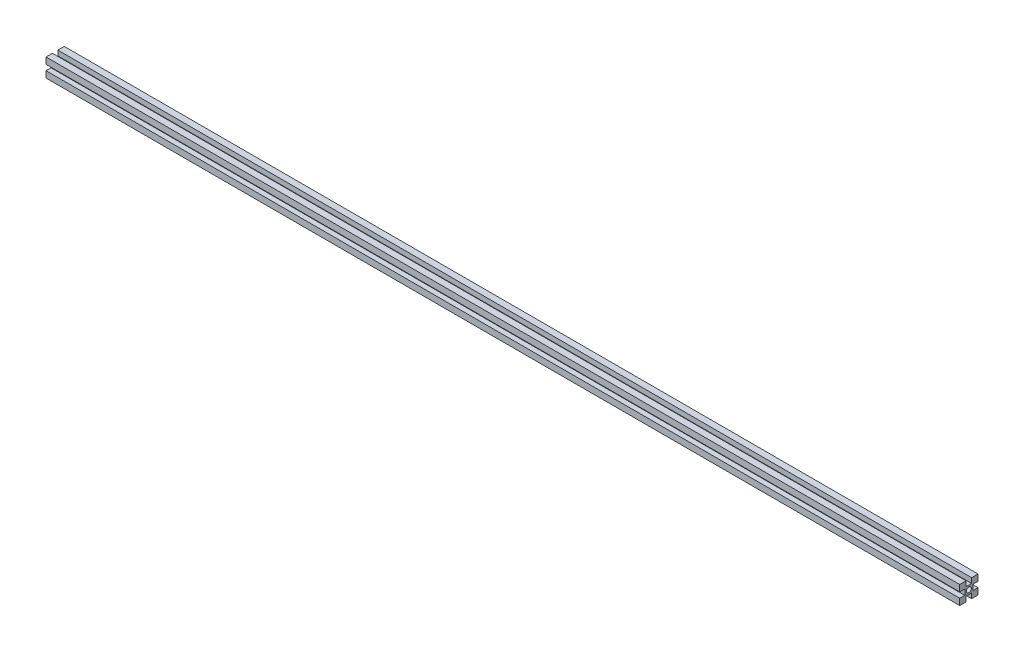
ISO-10303-21;
HEADER;
FILE_DESCRIPTION(('STEP AP214'),'2;1');
FILE_NAME('part.step','',(''),(''),'','','');
FILE_SCHEMA(('AUTOMOTIVE_DESIGN { 1 0 10303 214 1 1 1 1 }'));
ENDSEC;
DATA;
#1=APPLICATION_CONTEXT('core data for automotive mechanical design processes');
#2=APPLICATION_PROTOCOL_DEFINITION('international standard','automotive_design',2000,#1);
#3=PRODUCT_CONTEXT('',#1,'mechanical');
#4=PRODUCT('Part','Part','',(#3));
#5=PRODUCT_RELATED_PRODUCT_CATEGORY('part','',(#4));
#6=PRODUCT_DEFINITION_FORMATION('','',#4);
#7=PRODUCT_DEFINITION_CONTEXT('part definition',#1,'design');
#8=PRODUCT_DEFINITION('design','',#6,#7);
#9=PRODUCT_DEFINITION_SHAPE('','',#8);
#10=(LENGTH_UNIT() NAMED_UNIT(*) SI_UNIT(.MILLI.,.METRE.));
#11=(NAMED_UNIT(*) PLANE_ANGLE_UNIT() SI_UNIT($,.RADIAN.));
#12=(NAMED_UNIT(*) SI_UNIT($,.STERADIAN.) SOLID_ANGLE_UNIT());
#13=UNCERTAINTY_MEASURE_WITH_UNIT(LENGTH_MEASURE(1.E-05),#10,'distance_accuracy_value','');
#14=(GEOMETRIC_REPRESENTATION_CONTEXT(3) GLOBAL_UNCERTAINTY_ASSIGNED_CONTEXT((#13)) GLOBAL_UNIT_ASSIGNED_CONTEXT((#10,
#11,#12)) REPRESENTATION_CONTEXT('',''));
#15=CARTESIAN_POINT('',(0.,0.,0.));
#16=DIRECTION('',(0.,0.,1.));
#17=DIRECTION('',(1.,0.,0.));
#18=AXIS2_PLACEMENT_3D('',#15,#16,#17);
#19=CARTESIAN_POINT('',(1000.,10.,-9.99999999999994));
#20=DIRECTION('',(0.,0.,-1.));
#21=DIRECTION('',(-1.,0.,0.));
#22=AXIS2_PLACEMENT_3D('',#19,#20,#21);
#23=PLANE('',#22);
#24=DIRECTION('',(0.,-1.,0.));
#25=VECTOR('',#24,1.);
#26=CARTESIAN_POINT('',(0.,10.,-10.));
#27=LINE('',#26,#25);
#28=CARTESIAN_POINT('',(0.,10.,-10.));
#29=VERTEX_POINT('',#28);
#30=CARTESIAN_POINT('',(0.,3.,-10.));
#31=VERTEX_POINT('',#30);
#32=EDGE_CURVE('E202',#29,#31,#27,.T.);
#33=ORIENTED_EDGE('',*,*,#32,.F.);
#34=DIRECTION('',(-1.,0.,0.));
#35=VECTOR('',#34,1.);
#36=CARTESIAN_POINT('',(1000.,10.,-9.99999999999994));
#37=LINE('',#36,#35);
#38=CARTESIAN_POINT('',(1000.,10.,-9.99999999999994));
#39=VERTEX_POINT('',#38);
#40=EDGE_CURVE('E11',#39,#29,#37,.T.);
#41=ORIENTED_EDGE('',*,*,#40,.F.);
#42=DIRECTION('',(0.,-1.,0.));
#43=VECTOR('',#42,1.);
#44=CARTESIAN_POINT('',(1000.,10.,-9.99999999999994));
#45=LINE('',#44,#43);
#46=CARTESIAN_POINT('',(1000.,3.,-9.99999999999994));
#47=VERTEX_POINT('',#46);
#48=EDGE_CURVE('E259',#39,#47,#45,.T.);
#49=ORIENTED_EDGE('',*,*,#48,.T.);
#50=DIRECTION('',(-1.,0.,0.));
#51=VECTOR('',#50,1.);
#52=CARTESIAN_POINT('',(1000.,3.,-9.99999999999994));
#53=LINE('',#52,#51);
#54=EDGE_CURVE('E36',#47,#31,#53,.T.);
#55=ORIENTED_EDGE('',*,*,#54,.T.);
#56=EDGE_LOOP('',(#33,#41,#49,#55));
#57=FACE_BOUND('',#56,.T.);
#58=ADVANCED_FACE('F33',(#57),#23,.T.);
#59=CARTESIAN_POINT('',(1000.,10.,-2.99999999999994));
#60=DIRECTION('',(0.,1.,0.));
#61=DIRECTION('',(0.,0.,1.));
#62=AXIS2_PLACEMENT_3D('',#59,#60,#61);
#63=PLANE('',#62);
#64=DIRECTION('',(0.,0.,-1.));
#65=VECTOR('',#64,1.);
#66=CARTESIAN_POINT('',(0.,10.,-3.));
#67=LINE('',#66,#65);
#68=CARTESIAN_POINT('',(0.,10.,-3.));
#69=VERTEX_POINT('',#68);
#70=EDGE_CURVE('E257',#69,#29,#67,.T.);
#71=ORIENTED_EDGE('',*,*,#70,.F.);
#72=DIRECTION('',(-1.,0.,0.));
#73=VECTOR('',#72,1.);
#74=CARTESIAN_POINT('',(1000.,10.,-2.99999999999994));
#75=LINE('',#74,#73);
#76=CARTESIAN_POINT('',(1000.,10.,-2.99999999999994));
#77=VERTEX_POINT('',#76);
#78=EDGE_CURVE('E42',#77,#69,#75,.T.);
#79=ORIENTED_EDGE('',*,*,#78,.F.);
#80=DIRECTION('',(0.,0.,-1.));
#81=VECTOR('',#80,1.);
#82=CARTESIAN_POINT('',(1000.,10.,-2.99999999999994));
#83=LINE('',#82,#81);
#84=EDGE_CURVE('E192',#77,#39,#83,.T.);
#85=ORIENTED_EDGE('',*,*,#84,.T.);
#86=ORIENTED_EDGE('',*,*,#40,.T.);
#87=EDGE_LOOP('',(#71,#79,#85,#86));
#88=FACE_BOUND('',#87,.T.);
#89=ADVANCED_FACE('F295',(#88),#63,.T.);
#90=CARTESIAN_POINT('',(1000.,4.5,-2.99999999999994));
#91=DIRECTION('',(0.,0.,1.));
#92=DIRECTION('',(1.,0.,0.));
#93=AXIS2_PLACEMENT_3D('',#90,#91,#92);
#94=PLANE('',#93);
#95=DIRECTION('',(0.,1.,0.));
#96=VECTOR('',#95,1.);
#97=CARTESIAN_POINT('',(0.,4.5,-3.));
#98=LINE('',#97,#96);
#99=CARTESIAN_POINT('',(0.,4.5,-3.));
#100=VERTEX_POINT('',#99);
#101=EDGE_CURVE('E179',#100,#69,#98,.T.);
#102=ORIENTED_EDGE('',*,*,#101,.F.);
#103=DIRECTION('',(-1.,0.,0.));
#104=VECTOR('',#103,1.);
#105=CARTESIAN_POINT('',(1000.,4.5,-2.99999999999994));
#106=LINE('',#105,#104);
#107=CARTESIAN_POINT('',(1000.,4.5,-2.99999999999994));
#108=VERTEX_POINT('',#107);
#109=EDGE_CURVE('E174',#108,#100,#106,.T.);
#110=ORIENTED_EDGE('',*,*,#109,.F.);
#111=DIRECTION('',(0.,1.,0.));
#112=VECTOR('',#111,1.);
#113=CARTESIAN_POINT('',(1000.,4.5,-2.99999999999994));
#114=LINE('',#113,#112);
#115=EDGE_CURVE('E177',#108,#77,#114,.T.);
#116=ORIENTED_EDGE('',*,*,#115,.T.);
#117=ORIENTED_EDGE('',*,*,#78,.T.);
#118=EDGE_LOOP('',(#102,#110,#116,#117));
#119=FACE_BOUND('',#118,.T.);
#120=ADVANCED_FACE('F176',(#119),#94,.T.);
#121=CARTESIAN_POINT('',(1000.,4.5,3.00000000000006));
#122=DIRECTION('',(0.,1.,0.));
#123=DIRECTION('',(0.,0.,1.));
#124=AXIS2_PLACEMENT_3D('',#121,#122,#123);
#125=PLANE('',#124);
#126=DIRECTION('',(0.,0.,-1.));
#127=VECTOR('',#126,1.);
#128=CARTESIAN_POINT('',(0.,4.5,3.));
#129=LINE('',#128,#127);
#130=CARTESIAN_POINT('',(0.,4.5,3.));
#131=VERTEX_POINT('',#130);
#132=EDGE_CURVE('E254',#131,#100,#129,.T.);
#133=ORIENTED_EDGE('',*,*,#132,.F.);
#134=DIRECTION('',(-1.,0.,0.));
#135=VECTOR('',#134,1.);
#136=CARTESIAN_POINT('',(1000.,4.5,3.00000000000006));
#137=LINE('',#136,#135);
#138=CARTESIAN_POINT('',(1000.,4.5,3.00000000000006));
#139=VERTEX_POINT('',#138);
#140=EDGE_CURVE('E184',#139,#131,#137,.T.);
#141=ORIENTED_EDGE('',*,*,#140,.F.);
#142=DIRECTION('',(0.,0.,-1.));
#143=VECTOR('',#142,1.);
#144=CARTESIAN_POINT('',(1000.,4.5,3.00000000000006));
#145=LINE('',#144,#143);
#146=EDGE_CURVE('E190',#139,#108,#145,.T.);
#147=ORIENTED_EDGE('',*,*,#146,.T.);
#148=ORIENTED_EDGE('',*,*,#109,.T.);
#149=EDGE_LOOP('',(#133,#141,#147,#148));
#150=FACE_BOUND('',#149,.T.);
#151=ADVANCED_FACE('F194',(#150),#125,.T.);
#152=CARTESIAN_POINT('',(1000.,10.,3.00000000000006));
#153=DIRECTION('',(0.,0.,-1.));
#154=DIRECTION('',(-1.,0.,0.));
#155=AXIS2_PLACEMENT_3D('',#152,#153,#154);
#156=PLANE('',#155);
#157=DIRECTION('',(0.,-1.,0.));
#158=VECTOR('',#157,1.);
#159=CARTESIAN_POINT('',(0.,10.,3.));
#160=LINE('',#159,#158);
#161=CARTESIAN_POINT('',(0.,10.,3.));
#162=VERTEX_POINT('',#161);
#163=EDGE_CURVE('E251',#162,#131,#160,.T.);
#164=ORIENTED_EDGE('',*,*,#163,.F.);
#165=DIRECTION('',(-1.,0.,0.));
#166=VECTOR('',#165,1.);
#167=CARTESIAN_POINT('',(1000.,10.,3.00000000000006));
#168=LINE('',#167,#166);
#169=CARTESIAN_POINT('',(1000.,10.,3.00000000000006));
#170=VERTEX_POINT('',#169);
#171=EDGE_CURVE('E263',#170,#162,#168,.T.);
#172=ORIENTED_EDGE('',*,*,#171,.F.);
#173=DIRECTION('',(0.,-1.,0.));
#174=VECTOR('',#173,1.);
#175=CARTESIAN_POINT('',(1000.,10.,3.00000000000006));
#176=LINE('',#175,#174);
#177=EDGE_CURVE('E195',#170,#139,#176,.T.);
#178=ORIENTED_EDGE('',*,*,#177,.T.);
#179=ORIENTED_EDGE('',*,*,#140,.T.);
#180=EDGE_LOOP('',(#164,#172,#178,#179));
#181=FACE_BOUND('',#180,.T.);
#182=ADVANCED_FACE('F308',(#181),#156,.T.);
#183=CARTESIAN_POINT('',(1000.,10.,10.0000000000001));
#184=DIRECTION('',(0.,1.,0.));
#185=DIRECTION('',(0.,0.,1.));
#186=AXIS2_PLACEMENT_3D('',#183,#184,#185);
#187=PLANE('',#186);
#188=DIRECTION('',(0.,0.,-1.));
#189=VECTOR('',#188,1.);
#190=CARTESIAN_POINT('',(0.,10.,10.));
#191=LINE('',#190,#189);
#192=CARTESIAN_POINT('',(0.,10.,10.));
#193=VERTEX_POINT('',#192);
#194=EDGE_CURVE('E248',#193,#162,#191,.T.);
#195=ORIENTED_EDGE('',*,*,#194,.F.);
#196=DIRECTION('',(-1.,0.,0.));
#197=VECTOR('',#196,1.);
#198=CARTESIAN_POINT('',(1000.,10.,10.0000000000001));
#199=LINE('',#198,#197);
#200=CARTESIAN_POINT('',(1000.,10.,10.0000000000001));
#201=VERTEX_POINT('',#200);
#202=EDGE_CURVE('E265',#201,#193,#199,.T.);
#203=ORIENTED_EDGE('',*,*,#202,.F.);
#204=DIRECTION('',(0.,0.,-1.));
#205=VECTOR('',#204,1.);
#206=CARTESIAN_POINT('',(1000.,10.,10.0000000000001));
#207=LINE('',#206,#205);
#208=EDGE_CURVE('E197',#201,#170,#207,.T.);
#209=ORIENTED_EDGE('',*,*,#208,.T.);
#210=ORIENTED_EDGE('',*,*,#171,.T.);
#211=EDGE_LOOP('',(#195,#203,#209,#210));
#212=FACE_BOUND('',#211,.T.);
#213=ADVANCED_FACE('F311',(#212),#187,.T.);
#214=CARTESIAN_POINT('',(1000.,3.,10.0000000000001));
#215=DIRECTION('',(0.,0.,1.));
#216=DIRECTION('',(1.,0.,0.));
#217=AXIS2_PLACEMENT_3D('',#214,#215,#216);
#218=PLANE('',#217);
#219=DIRECTION('',(0.,1.,0.));
#220=VECTOR('',#219,1.);
#221=CARTESIAN_POINT('',(0.,3.,10.));
#222=LINE('',#221,#220);
#223=CARTESIAN_POINT('',(0.,3.,10.));
#224=VERTEX_POINT('',#223);
#225=EDGE_CURVE('E245',#224,#193,#222,.T.);
#226=ORIENTED_EDGE('',*,*,#225,.F.);
#227=DIRECTION('',(-1.,0.,0.));
#228=VECTOR('',#227,1.);
#229=CARTESIAN_POINT('',(1000.,3.,10.0000000000001));
#230=LINE('',#229,#228);
#231=CARTESIAN_POINT('',(1000.,3.,10.0000000000001));
#232=VERTEX_POINT('',#231);
#233=EDGE_CURVE('E267',#232,#224,#230,.T.);
#234=ORIENTED_EDGE('',*,*,#233,.F.);
#235=DIRECTION('',(0.,1.,0.));
#236=VECTOR('',#235,1.);
#237=CARTESIAN_POINT('',(1000.,3.,10.0000000000001));
#238=LINE('',#237,#236);
#239=EDGE_CURVE('E430',#232,#201,#238,.T.);
#240=ORIENTED_EDGE('',*,*,#239,.T.);
#241=ORIENTED_EDGE('',*,*,#202,.T.);
#242=EDGE_LOOP('',(#226,#234,#240,#241));
#243=FACE_BOUND('',#242,.T.);
#244=ADVANCED_FACE('F315',(#243),#218,.T.);
#245=CARTESIAN_POINT('',(1000.,3.,4.50000000000006));
#246=DIRECTION('',(0.,-1.,0.));
#247=DIRECTION('',(0.,0.,-1.));
#248=AXIS2_PLACEMENT_3D('',#245,#246,#247);
#249=PLANE('',#248);
#250=DIRECTION('',(0.,0.,1.));
#251=VECTOR('',#250,1.);
#252=CARTESIAN_POINT('',(0.,3.,4.5));
#253=LINE('',#252,#251);
#254=CARTESIAN_POINT('',(0.,3.,4.5));
#255=VERTEX_POINT('',#254);
#256=EDGE_CURVE('E242',#255,#224,#253,.T.);
#257=ORIENTED_EDGE('',*,*,#256,.F.);
#258=DIRECTION('',(-1.,0.,0.));
#259=VECTOR('',#258,1.);
#260=CARTESIAN_POINT('',(1000.,3.,4.50000000000006));
#261=LINE('',#260,#259);
#262=CARTESIAN_POINT('',(1000.,3.,4.50000000000006));
#263=VERTEX_POINT('',#262);
#264=EDGE_CURVE('E269',#263,#255,#261,.T.);
#265=ORIENTED_EDGE('',*,*,#264,.F.);
#266=DIRECTION('',(0.,0.,1.));
#267=VECTOR('',#266,1.);
#268=CARTESIAN_POINT('',(1000.,3.,4.50000000000006));
#269=LINE('',#268,#267);
#270=EDGE_CURVE('E427',#263,#232,#269,.T.);
#271=ORIENTED_EDGE('',*,*,#270,.T.);
#272=ORIENTED_EDGE('',*,*,#233,.T.);
#273=EDGE_LOOP('',(#257,#265,#271,#272));
#274=FACE_BOUND('',#273,.T.);
#275=ADVANCED_FACE('F319',(#274),#249,.T.);
#276=CARTESIAN_POINT('',(1000.,-3.,4.50000000000006));
#277=DIRECTION('',(0.,0.,1.));
#278=DIRECTION('',(1.,0.,0.));
#279=AXIS2_PLACEMENT_3D('',#276,#277,#278);
#280=PLANE('',#279);
#281=DIRECTION('',(0.,1.,0.));
#282=VECTOR('',#281,1.);
#283=CARTESIAN_POINT('',(0.,-3.,4.5));
#284=LINE('',#283,#282);
#285=CARTESIAN_POINT('',(0.,-3.,4.5));
#286=VERTEX_POINT('',#285);
#287=EDGE_CURVE('E239',#286,#255,#284,.T.);
#288=ORIENTED_EDGE('',*,*,#287,.F.);
#289=DIRECTION('',(-1.,0.,0.));
#290=VECTOR('',#289,1.);
#291=CARTESIAN_POINT('',(1000.,-3.,4.50000000000006));
#292=LINE('',#291,#290);
#293=CARTESIAN_POINT('',(1000.,-3.,4.50000000000006));
#294=VERTEX_POINT('',#293);
#295=EDGE_CURVE('E271',#294,#286,#292,.T.);
#296=ORIENTED_EDGE('',*,*,#295,.F.);
#297=DIRECTION('',(0.,1.,0.));
#298=VECTOR('',#297,1.);
#299=CARTESIAN_POINT('',(1000.,-3.,4.50000000000006));
#300=LINE('',#299,#298);
#301=EDGE_CURVE('E424',#294,#263,#300,.T.);
#302=ORIENTED_EDGE('',*,*,#301,.T.);
#303=ORIENTED_EDGE('',*,*,#264,.T.);
#304=EDGE_LOOP('',(#288,#296,#302,#303));
#305=FACE_BOUND('',#304,.T.);
#306=ADVANCED_FACE('F323',(#305),#280,.T.);
#307=CARTESIAN_POINT('',(1000.,-3.,10.0000000000001));
#308=DIRECTION('',(0.,1.,0.));
#309=DIRECTION('',(0.,0.,1.));
#310=AXIS2_PLACEMENT_3D('',#307,#308,#309);
#311=PLANE('',#310);
#312=DIRECTION('',(0.,0.,-1.));
#313=VECTOR('',#312,1.);
#314=CARTESIAN_POINT('',(0.,-3.,10.));
#315=LINE('',#314,#313);
#316=CARTESIAN_POINT('',(0.,-3.,10.));
#317=VERTEX_POINT('',#316);
#318=EDGE_CURVE('E236',#317,#286,#315,.T.);
#319=ORIENTED_EDGE('',*,*,#318,.F.);
#320=DIRECTION('',(-1.,0.,0.));
#321=VECTOR('',#320,1.);
#322=CARTESIAN_POINT('',(1000.,-3.,10.0000000000001));
#323=LINE('',#322,#321);
#324=CARTESIAN_POINT('',(1000.,-3.,10.0000000000001));
#325=VERTEX_POINT('',#324);
#326=EDGE_CURVE('E273',#325,#317,#323,.T.);
#327=ORIENTED_EDGE('',*,*,#326,.F.);
#328=DIRECTION('',(0.,0.,-1.));
#329=VECTOR('',#328,1.);
#330=CARTESIAN_POINT('',(1000.,-3.,10.0000000000001));
#331=LINE('',#330,#329);
#332=EDGE_CURVE('E421',#325,#294,#331,.T.);
#333=ORIENTED_EDGE('',*,*,#332,.T.);
#334=ORIENTED_EDGE('',*,*,#295,.T.);
#335=EDGE_LOOP('',(#319,#327,#333,#334));
#336=FACE_BOUND('',#335,.T.);
#337=ADVANCED_FACE('F327',(#336),#311,.T.);
#338=CARTESIAN_POINT('',(1000.,-10.,10.0000000000001));
#339=DIRECTION('',(0.,0.,1.));
#340=DIRECTION('',(1.,0.,0.));
#341=AXIS2_PLACEMENT_3D('',#338,#339,#340);
#342=PLANE('',#341);
#343=DIRECTION('',(0.,1.,0.));
#344=VECTOR('',#343,1.);
#345=CARTESIAN_POINT('',(0.,-10.,10.));
#346=LINE('',#345,#344);
#347=CARTESIAN_POINT('',(0.,-10.,10.));
#348=VERTEX_POINT('',#347);
#349=EDGE_CURVE('E233',#348,#317,#346,.T.);
#350=ORIENTED_EDGE('',*,*,#349,.F.);
#351=DIRECTION('',(-1.,0.,0.));
#352=VECTOR('',#351,1.);
#353=CARTESIAN_POINT('',(1000.,-10.,10.0000000000001));
#354=LINE('',#353,#352);
#355=CARTESIAN_POINT('',(1000.,-10.,10.0000000000001));
#356=VERTEX_POINT('',#355);
#357=EDGE_CURVE('E275',#356,#348,#354,.T.);
#358=ORIENTED_EDGE('',*,*,#357,.F.);
#359=DIRECTION('',(0.,1.,0.));
#360=VECTOR('',#359,1.);
#361=CARTESIAN_POINT('',(1000.,-10.,10.0000000000001));
#362=LINE('',#361,#360);
#363=EDGE_CURVE('E418',#356,#325,#362,.T.);
#364=ORIENTED_EDGE('',*,*,#363,.T.);
#365=ORIENTED_EDGE('',*,*,#326,.T.);
#366=EDGE_LOOP('',(#350,#358,#364,#365));
#367=FACE_BOUND('',#366,.T.);
#368=ADVANCED_FACE('F331',(#367),#342,.T.);
#369=CARTESIAN_POINT('',(1000.,-10.,3.00000000000006));
#370=DIRECTION('',(0.,-1.,0.));
#371=DIRECTION('',(0.,0.,-1.));
#372=AXIS2_PLACEMENT_3D('',#369,#370,#371);
#373=PLANE('',#372);
#374=DIRECTION('',(0.,0.,1.));
#375=VECTOR('',#374,1.);
#376=CARTESIAN_POINT('',(0.,-10.,3.));
#377=LINE('',#376,#375);
#378=CARTESIAN_POINT('',(0.,-10.,3.));
#379=VERTEX_POINT('',#378);
#380=EDGE_CURVE('E230',#379,#348,#377,.T.);
#381=ORIENTED_EDGE('',*,*,#380,.F.);
#382=DIRECTION('',(-1.,0.,0.));
#383=VECTOR('',#382,1.);
#384=CARTESIAN_POINT('',(1000.,-10.,3.00000000000006));
#385=LINE('',#384,#383);
#386=CARTESIAN_POINT('',(1000.,-10.,3.00000000000006));
#387=VERTEX_POINT('',#386);
#388=EDGE_CURVE('E277',#387,#379,#385,.T.);
#389=ORIENTED_EDGE('',*,*,#388,.F.);
#390=DIRECTION('',(0.,0.,1.));
#391=VECTOR('',#390,1.);
#392=CARTESIAN_POINT('',(1000.,-10.,3.00000000000006));
#393=LINE('',#392,#391);
#394=EDGE_CURVE('E415',#387,#356,#393,.T.);
#395=ORIENTED_EDGE('',*,*,#394,.T.);
#396=ORIENTED_EDGE('',*,*,#357,.T.);
#397=EDGE_LOOP('',(#381,#389,#395,#396));
#398=FACE_BOUND('',#397,.T.);
#399=ADVANCED_FACE('F335',(#398),#373,.T.);
#400=CARTESIAN_POINT('',(1000.,-4.5,3.00000000000006));
#401=DIRECTION('',(0.,0.,-1.));
#402=DIRECTION('',(-1.,0.,0.));
#403=AXIS2_PLACEMENT_3D('',#400,#401,#402);
#404=PLANE('',#403);
#405=DIRECTION('',(0.,-1.,0.));
#406=VECTOR('',#405,1.);
#407=CARTESIAN_POINT('',(0.,-4.5,3.));
#408=LINE('',#407,#406);
#409=CARTESIAN_POINT('',(0.,-4.5,3.));
#410=VERTEX_POINT('',#409);
#411=EDGE_CURVE('E227',#410,#379,#408,.T.);
#412=ORIENTED_EDGE('',*,*,#411,.F.);
#413=DIRECTION('',(-1.,0.,0.));
#414=VECTOR('',#413,1.);
#415=CARTESIAN_POINT('',(1000.,-4.5,3.00000000000006));
#416=LINE('',#415,#414);
#417=CARTESIAN_POINT('',(1000.,-4.5,3.00000000000006));
#418=VERTEX_POINT('',#417);
#419=EDGE_CURVE('E279',#418,#410,#416,.T.);
#420=ORIENTED_EDGE('',*,*,#419,.F.);
#421=DIRECTION('',(0.,-1.,0.));
#422=VECTOR('',#421,1.);
#423=CARTESIAN_POINT('',(1000.,-4.5,3.00000000000006));
#424=LINE('',#423,#422);
#425=EDGE_CURVE('E412',#418,#387,#424,.T.);
#426=ORIENTED_EDGE('',*,*,#425,.T.);
#427=ORIENTED_EDGE('',*,*,#388,.T.);
#428=EDGE_LOOP('',(#412,#420,#426,#427));
#429=FACE_BOUND('',#428,.T.);
#430=ADVANCED_FACE('F339',(#429),#404,.T.);
#431=CARTESIAN_POINT('',(1000.,-4.5,-2.99999999999994));
#432=DIRECTION('',(0.,-1.,0.));
#433=DIRECTION('',(0.,0.,-1.));
#434=AXIS2_PLACEMENT_3D('',#431,#432,#433);
#435=PLANE('',#434);
#436=DIRECTION('',(0.,0.,1.));
#437=VECTOR('',#436,1.);
#438=CARTESIAN_POINT('',(0.,-4.5,-3.));
#439=LINE('',#438,#437);
#440=CARTESIAN_POINT('',(0.,-4.5,-3.));
#441=VERTEX_POINT('',#440);
#442=EDGE_CURVE('E224',#441,#410,#439,.T.);
#443=ORIENTED_EDGE('',*,*,#442,.F.);
#444=DIRECTION('',(-1.,0.,0.));
#445=VECTOR('',#444,1.);
#446=CARTESIAN_POINT('',(1000.,-4.5,-2.99999999999994));
#447=LINE('',#446,#445);
#448=CARTESIAN_POINT('',(1000.,-4.5,-2.99999999999994));
#449=VERTEX_POINT('',#448);
#450=EDGE_CURVE('E281',#449,#441,#447,.T.);
#451=ORIENTED_EDGE('',*,*,#450,.F.);
#452=DIRECTION('',(0.,0.,1.));
#453=VECTOR('',#452,1.);
#454=CARTESIAN_POINT('',(1000.,-4.5,-2.99999999999994));
#455=LINE('',#454,#453);
#456=EDGE_CURVE('E409',#449,#418,#455,.T.);
#457=ORIENTED_EDGE('',*,*,#456,.T.);
#458=ORIENTED_EDGE('',*,*,#419,.T.);
#459=EDGE_LOOP('',(#443,#451,#457,#458));
#460=FACE_BOUND('',#459,.T.);
#461=ADVANCED_FACE('F343',(#460),#435,.T.);
#462=CARTESIAN_POINT('',(1000.,-10.,-2.99999999999994));
#463=DIRECTION('',(0.,0.,1.));
#464=DIRECTION('',(1.,0.,0.));
#465=AXIS2_PLACEMENT_3D('',#462,#463,#464);
#466=PLANE('',#465);
#467=DIRECTION('',(0.,1.,0.));
#468=VECTOR('',#467,1.);
#469=CARTESIAN_POINT('',(0.,-10.,-3.));
#470=LINE('',#469,#468);
#471=CARTESIAN_POINT('',(0.,-10.,-3.));
#472=VERTEX_POINT('',#471);
#473=EDGE_CURVE('E221',#472,#441,#470,.T.);
#474=ORIENTED_EDGE('',*,*,#473,.F.);
#475=DIRECTION('',(-1.,0.,0.));
#476=VECTOR('',#475,1.);
#477=CARTESIAN_POINT('',(1000.,-10.,-2.99999999999994));
#478=LINE('',#477,#476);
#479=CARTESIAN_POINT('',(1000.,-10.,-2.99999999999994));
#480=VERTEX_POINT('',#479);
#481=EDGE_CURVE('E283',#480,#472,#478,.T.);
#482=ORIENTED_EDGE('',*,*,#481,.F.);
#483=DIRECTION('',(0.,1.,0.));
#484=VECTOR('',#483,1.);
#485=CARTESIAN_POINT('',(1000.,-10.,-2.99999999999994));
#486=LINE('',#485,#484);
#487=EDGE_CURVE('E406',#480,#449,#486,.T.);
#488=ORIENTED_EDGE('',*,*,#487,.T.);
#489=ORIENTED_EDGE('',*,*,#450,.T.);
#490=EDGE_LOOP('',(#474,#482,#488,#489));
#491=FACE_BOUND('',#490,.T.);
#492=ADVANCED_FACE('F347',(#491),#466,.T.);
#493=CARTESIAN_POINT('',(1000.,-10.,-9.99999999999994));
#494=DIRECTION('',(0.,-1.,0.));
#495=DIRECTION('',(0.,0.,-1.));
#496=AXIS2_PLACEMENT_3D('',#493,#494,#495);
#497=PLANE('',#496);
#498=DIRECTION('',(0.,0.,1.));
#499=VECTOR('',#498,1.);
#500=CARTESIAN_POINT('',(0.,-10.,-10.));
#501=LINE('',#500,#499);
#502=CARTESIAN_POINT('',(0.,-10.,-10.));
#503=VERTEX_POINT('',#502);
#504=EDGE_CURVE('E218',#503,#472,#501,.T.);
#505=ORIENTED_EDGE('',*,*,#504,.F.);
#506=DIRECTION('',(-1.,0.,0.));
#507=VECTOR('',#506,1.);
#508=CARTESIAN_POINT('',(1000.,-10.,-9.99999999999994));
#509=LINE('',#508,#507);
#510=CARTESIAN_POINT('',(1000.,-10.,-9.99999999999994));
#511=VERTEX_POINT('',#510);
#512=EDGE_CURVE('E285',#511,#503,#509,.T.);
#513=ORIENTED_EDGE('',*,*,#512,.F.);
#514=DIRECTION('',(0.,0.,1.));
#515=VECTOR('',#514,1.);
#516=CARTESIAN_POINT('',(1000.,-10.,-9.99999999999994));
#517=LINE('',#516,#515);
#518=EDGE_CURVE('E403',#511,#480,#517,.T.);
#519=ORIENTED_EDGE('',*,*,#518,.T.);
#520=ORIENTED_EDGE('',*,*,#481,.T.);
#521=EDGE_LOOP('',(#505,#513,#519,#520));
#522=FACE_BOUND('',#521,.T.);
#523=ADVANCED_FACE('F351',(#522),#497,.T.);
#524=CARTESIAN_POINT('',(1000.,-3.,-9.99999999999994));
#525=DIRECTION('',(0.,0.,-1.));
#526=DIRECTION('',(-1.,0.,0.));
#527=AXIS2_PLACEMENT_3D('',#524,#525,#526);
#528=PLANE('',#527);
#529=DIRECTION('',(0.,-1.,0.));
#530=VECTOR('',#529,1.);
#531=CARTESIAN_POINT('',(0.,-3.,-10.));
#532=LINE('',#531,#530);
#533=CARTESIAN_POINT('',(0.,-3.,-10.));
#534=VERTEX_POINT('',#533);
#535=EDGE_CURVE('E215',#534,#503,#532,.T.);
#536=ORIENTED_EDGE('',*,*,#535,.F.);
#537=DIRECTION('',(-1.,0.,0.));
#538=VECTOR('',#537,1.);
#539=CARTESIAN_POINT('',(1000.,-3.,-9.99999999999994));
#540=LINE('',#539,#538);
#541=CARTESIAN_POINT('',(1000.,-3.,-9.99999999999994));
#542=VERTEX_POINT('',#541);
#543=EDGE_CURVE('E287',#542,#534,#540,.T.);
#544=ORIENTED_EDGE('',*,*,#543,.F.);
#545=DIRECTION('',(0.,-1.,0.));
#546=VECTOR('',#545,1.);
#547=CARTESIAN_POINT('',(1000.,-3.,-9.99999999999994));
#548=LINE('',#547,#546);
#549=EDGE_CURVE('E400',#542,#511,#548,.T.);
#550=ORIENTED_EDGE('',*,*,#549,.T.);
#551=ORIENTED_EDGE('',*,*,#512,.T.);
#552=EDGE_LOOP('',(#536,#544,#550,#551));
#553=FACE_BOUND('',#552,.T.);
#554=ADVANCED_FACE('F355',(#553),#528,.T.);
#555=CARTESIAN_POINT('',(1000.,-3.,-4.49999999999994));
#556=DIRECTION('',(0.,1.,0.));
#557=DIRECTION('',(0.,0.,1.));
#558=AXIS2_PLACEMENT_3D('',#555,#556,#557);
#559=PLANE('',#558);
#560=DIRECTION('',(0.,0.,-1.));
#561=VECTOR('',#560,1.);
#562=CARTESIAN_POINT('',(0.,-3.,-4.5));
#563=LINE('',#562,#561);
#564=CARTESIAN_POINT('',(0.,-3.,-4.5));
#565=VERTEX_POINT('',#564);
#566=EDGE_CURVE('E212',#565,#534,#563,.T.);
#567=ORIENTED_EDGE('',*,*,#566,.F.);
#568=DIRECTION('',(-1.,0.,0.));
#569=VECTOR('',#568,1.);
#570=CARTESIAN_POINT('',(1000.,-3.,-4.49999999999994));
#571=LINE('',#570,#569);
#572=CARTESIAN_POINT('',(1000.,-3.,-4.49999999999994));
#573=VERTEX_POINT('',#572);
#574=EDGE_CURVE('E289',#573,#565,#571,.T.);
#575=ORIENTED_EDGE('',*,*,#574,.F.);
#576=DIRECTION('',(0.,0.,-1.));
#577=VECTOR('',#576,1.);
#578=CARTESIAN_POINT('',(1000.,-3.,-4.49999999999994));
#579=LINE('',#578,#577);
#580=EDGE_CURVE('E397',#573,#542,#579,.T.);
#581=ORIENTED_EDGE('',*,*,#580,.T.);
#582=ORIENTED_EDGE('',*,*,#543,.T.);
#583=EDGE_LOOP('',(#567,#575,#581,#582));
#584=FACE_BOUND('',#583,.T.);
#585=ADVANCED_FACE('F359',(#584),#559,.T.);
#586=CARTESIAN_POINT('',(1000.,3.,-4.49999999999994));
#587=DIRECTION('',(0.,0.,-1.));
#588=DIRECTION('',(-1.,0.,0.));
#589=AXIS2_PLACEMENT_3D('',#586,#587,#588);
#590=PLANE('',#589);
#591=DIRECTION('',(0.,-1.,0.));
#592=VECTOR('',#591,1.);
#593=CARTESIAN_POINT('',(0.,3.,-4.5));
#594=LINE('',#593,#592);
#595=CARTESIAN_POINT('',(0.,3.,-4.5));
#596=VERTEX_POINT('',#595);
#597=EDGE_CURVE('E209',#596,#565,#594,.T.);
#598=ORIENTED_EDGE('',*,*,#597,.F.);
#599=DIRECTION('',(-1.,0.,0.));
#600=VECTOR('',#599,1.);
#601=CARTESIAN_POINT('',(1000.,3.,-4.49999999999994));
#602=LINE('',#601,#600);
#603=CARTESIAN_POINT('',(1000.,3.,-4.49999999999994));
#604=VERTEX_POINT('',#603);
#605=EDGE_CURVE('E290',#604,#596,#602,.T.);
#606=ORIENTED_EDGE('',*,*,#605,.F.);
#607=DIRECTION('',(0.,-1.,0.));
#608=VECTOR('',#607,1.);
#609=CARTESIAN_POINT('',(1000.,3.,-4.49999999999994));
#610=LINE('',#609,#608);
#611=EDGE_CURVE('E394',#604,#573,#610,.T.);
#612=ORIENTED_EDGE('',*,*,#611,.T.);
#613=ORIENTED_EDGE('',*,*,#574,.T.);
#614=EDGE_LOOP('',(#598,#606,#612,#613));
#615=FACE_BOUND('',#614,.T.);
#616=ADVANCED_FACE('F363',(#615),#590,.T.);
#617=CARTESIAN_POINT('',(1000.,3.,-9.99999999999994));
#618=DIRECTION('',(0.,-1.,0.));
#619=DIRECTION('',(0.,0.,-1.));
#620=AXIS2_PLACEMENT_3D('',#617,#618,#619);
#621=PLANE('',#620);
#622=DIRECTION('',(0.,0.,1.));
#623=VECTOR('',#622,1.);
#624=CARTESIAN_POINT('',(0.,3.,-10.));
#625=LINE('',#624,#623);
#626=EDGE_CURVE('E205',#31,#596,#625,.T.);
#627=ORIENTED_EDGE('',*,*,#626,.F.);
#628=ORIENTED_EDGE('',*,*,#54,.F.);
#629=DIRECTION('',(0.,0.,1.));
#630=VECTOR('',#629,1.);
#631=CARTESIAN_POINT('',(1000.,3.,-9.99999999999994));
#632=LINE('',#631,#630);
#633=EDGE_CURVE('E392',#47,#604,#632,.T.);
#634=ORIENTED_EDGE('',*,*,#633,.T.);
#635=ORIENTED_EDGE('',*,*,#605,.T.);
#636=EDGE_LOOP('',(#627,#628,#634,#635));
#637=FACE_BOUND('',#636,.T.);
#638=ADVANCED_FACE('F292',(#637),#621,.T.);
#639=CARTESIAN_POINT('',(1000.,0.,0.));
#640=DIRECTION('',(-1.,0.,0.));
#641=DIRECTION('',(0.,0.,1.));
#642=AXIS2_PLACEMENT_3D('',#639,#640,#641);
#643=PLANE('',#642);
#644=CARTESIAN_POINT('',(1000.,0.,0.));
#645=DIRECTION('',(-1.,0.,0.));
#646=DIRECTION('',(0.,0.,-1.));
#647=AXIS2_PLACEMENT_3D('',#644,#645,#646);
#648=CIRCLE('',#647,2.75);
#649=CARTESIAN_POINT('',(1000.,0.,-2.74999999999994));
#650=VERTEX_POINT('',#649);
#651=EDGE_CURVE('E206',#650,#650,#648,.T.);
#652=ORIENTED_EDGE('',*,*,#651,.T.);
#653=EDGE_LOOP('',(#652));
#654=FACE_BOUND('',#653,.T.);
#655=ORIENTED_EDGE('',*,*,#48,.F.);
#656=ORIENTED_EDGE('',*,*,#84,.F.);
#657=ORIENTED_EDGE('',*,*,#115,.F.);
#658=ORIENTED_EDGE('',*,*,#146,.F.);
#659=ORIENTED_EDGE('',*,*,#177,.F.);
#660=ORIENTED_EDGE('',*,*,#208,.F.);
#661=ORIENTED_EDGE('',*,*,#239,.F.);
#662=ORIENTED_EDGE('',*,*,#270,.F.);
#663=ORIENTED_EDGE('',*,*,#301,.F.);
#664=ORIENTED_EDGE('',*,*,#332,.F.);
#665=ORIENTED_EDGE('',*,*,#363,.F.);
#666=ORIENTED_EDGE('',*,*,#394,.F.);
#667=ORIENTED_EDGE('',*,*,#425,.F.);
#668=ORIENTED_EDGE('',*,*,#456,.F.);
#669=ORIENTED_EDGE('',*,*,#487,.F.);
#670=ORIENTED_EDGE('',*,*,#518,.F.);
#671=ORIENTED_EDGE('',*,*,#549,.F.);
#672=ORIENTED_EDGE('',*,*,#580,.F.);
#673=ORIENTED_EDGE('',*,*,#611,.F.);
#674=ORIENTED_EDGE('',*,*,#633,.F.);
#675=EDGE_LOOP('',(#655,#656,#657,#658,#659,#660,#661,#662,#663,#664,#665,#666,#667,#668,#669,
#670,#671,#672,#673,#674));
#676=FACE_BOUND('',#675,.T.);
#677=ADVANCED_FACE('F188',(#654,#676),#643,.F.);
#678=CARTESIAN_POINT('',(0.,0.,0.));
#679=DIRECTION('',(-1.,0.,0.));
#680=DIRECTION('',(0.,0.,1.));
#681=AXIS2_PLACEMENT_3D('',#678,#679,#680);
#682=PLANE('',#681);
#683=CARTESIAN_POINT('',(0.,0.,0.));
#684=DIRECTION('',(-1.,0.,0.));
#685=DIRECTION('',(0.,0.,-1.));
#686=AXIS2_PLACEMENT_3D('',#683,#684,#685);
#687=CIRCLE('',#686,2.75);
#688=CARTESIAN_POINT('',(0.,0.,-2.75));
#689=VERTEX_POINT('',#688);
#690=EDGE_CURVE('E387',#689,#689,#687,.T.);
#691=ORIENTED_EDGE('',*,*,#690,.F.);
#692=EDGE_LOOP('',(#691));
#693=FACE_BOUND('',#692,.T.);
#694=ORIENTED_EDGE('',*,*,#32,.T.);
#695=ORIENTED_EDGE('',*,*,#626,.T.);
#696=ORIENTED_EDGE('',*,*,#597,.T.);
#697=ORIENTED_EDGE('',*,*,#566,.T.);
#698=ORIENTED_EDGE('',*,*,#535,.T.);
#699=ORIENTED_EDGE('',*,*,#504,.T.);
#700=ORIENTED_EDGE('',*,*,#473,.T.);
#701=ORIENTED_EDGE('',*,*,#442,.T.);
#702=ORIENTED_EDGE('',*,*,#411,.T.);
#703=ORIENTED_EDGE('',*,*,#380,.T.);
#704=ORIENTED_EDGE('',*,*,#349,.T.);
#705=ORIENTED_EDGE('',*,*,#318,.T.);
#706=ORIENTED_EDGE('',*,*,#287,.T.);
#707=ORIENTED_EDGE('',*,*,#256,.T.);
#708=ORIENTED_EDGE('',*,*,#225,.T.);
#709=ORIENTED_EDGE('',*,*,#194,.T.);
#710=ORIENTED_EDGE('',*,*,#163,.T.);
#711=ORIENTED_EDGE('',*,*,#132,.T.);
#712=ORIENTED_EDGE('',*,*,#101,.T.);
#713=ORIENTED_EDGE('',*,*,#70,.T.);
#714=EDGE_LOOP('',(#694,#695,#696,#697,#698,#699,#700,#701,#702,#703,#704,#705,#706,#707,#708,
#709,#710,#711,#712,#713));
#715=FACE_BOUND('',#714,.T.);
#716=ADVANCED_FACE('F294',(#693,#715),#682,.T.);
#717=CARTESIAN_POINT('',(1000.,0.,0.));
#718=DIRECTION('',(-1.,0.,0.));
#719=DIRECTION('',(0.,0.,1.));
#720=AXIS2_PLACEMENT_3D('',#717,#718,#719);
#721=CYLINDRICAL_SURFACE('',#720,2.75);
#722=ORIENTED_EDGE('',*,*,#651,.F.);
#723=EDGE_LOOP('',(#722));
#724=FACE_BOUND('',#723,.T.);
#725=ORIENTED_EDGE('',*,*,#690,.T.);
#726=EDGE_LOOP('',(#725));
#727=FACE_BOUND('',#726,.T.);
#728=ADVANCED_FACE('F375',(#724,#727),#721,.F.);
#729=CLOSED_SHELL('',(#58,#89,#120,#151,#182,#213,#244,#275,#306,#337,#368,#399,#430,#461,#492,
#523,#554,#585,#616,#638,#677,#716,#728));
#730=MANIFOLD_SOLID_BREP('B2',#729);
#731=ADVANCED_BREP_SHAPE_REPRESENTATION('',(#18,#730),#14);
#732=SHAPE_DEFINITION_REPRESENTATION(#9,#731);
ENDSEC;
END-ISO-10303-21;
